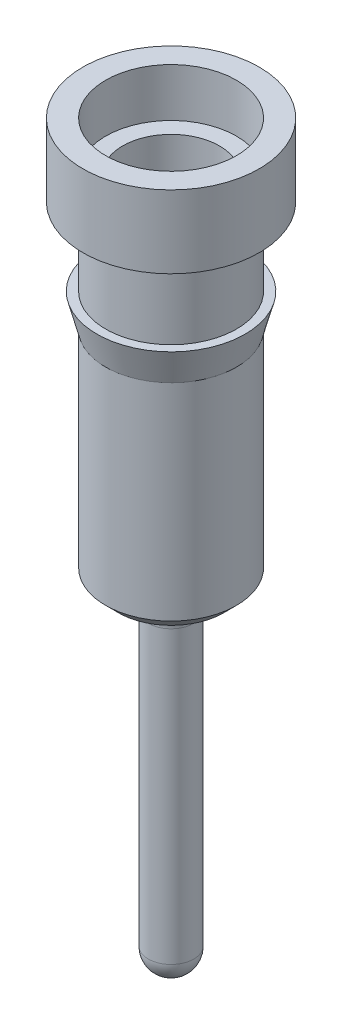
ISO-10303-21;
HEADER;
FILE_DESCRIPTION(('STEP AP214'),'2;1');
FILE_NAME('part.step','',(''),(''),'','','');
FILE_SCHEMA(('AUTOMOTIVE_DESIGN { 1 0 10303 214 1 1 1 1 }'));
ENDSEC;
DATA;
#1=APPLICATION_CONTEXT('core data for automotive mechanical design processes');
#2=APPLICATION_PROTOCOL_DEFINITION('international standard','automotive_design',2000,#1);
#3=PRODUCT_CONTEXT('',#1,'mechanical');
#4=PRODUCT('Part','Part','',(#3));
#5=PRODUCT_RELATED_PRODUCT_CATEGORY('part','',(#4));
#6=PRODUCT_DEFINITION_FORMATION('','',#4);
#7=PRODUCT_DEFINITION_CONTEXT('part definition',#1,'design');
#8=PRODUCT_DEFINITION('design','',#6,#7);
#9=PRODUCT_DEFINITION_SHAPE('','',#8);
#10=(LENGTH_UNIT() NAMED_UNIT(*) SI_UNIT(.MILLI.,.METRE.));
#11=(NAMED_UNIT(*) PLANE_ANGLE_UNIT() SI_UNIT($,.RADIAN.));
#12=(NAMED_UNIT(*) SI_UNIT($,.STERADIAN.) SOLID_ANGLE_UNIT());
#13=UNCERTAINTY_MEASURE_WITH_UNIT(LENGTH_MEASURE(1.E-05),#10,'distance_accuracy_value','');
#14=(GEOMETRIC_REPRESENTATION_CONTEXT(3) GLOBAL_UNCERTAINTY_ASSIGNED_CONTEXT((#13)) GLOBAL_UNIT_ASSIGNED_CONTEXT((#10,
#11,#12)) REPRESENTATION_CONTEXT('',''));
#15=CARTESIAN_POINT('',(0.,0.,0.));
#16=DIRECTION('',(0.,0.,1.));
#17=DIRECTION('',(1.,0.,0.));
#18=AXIS2_PLACEMENT_3D('',#15,#16,#17);
#19=CARTESIAN_POINT('',(0.,0.,0.));
#20=DIRECTION('',(0.,0.,1.));
#21=DIRECTION('',(1.,0.,0.));
#22=AXIS2_PLACEMENT_3D('',#19,#20,#21);
#23=SPHERICAL_SURFACE('',#22,0.235000000000001);
#24=CARTESIAN_POINT('',(0.,0.,0.));
#25=DIRECTION('',(0.,-1.,0.));
#26=DIRECTION('',(0.,0.,-1.));
#27=AXIS2_PLACEMENT_3D('',#24,#25,#26);
#28=SPHERICAL_SURFACE('',#27,0.235000000000001);
#29=CARTESIAN_POINT('',(0.,0.,0.));
#30=DIRECTION('',(0.,-1.,0.));
#31=DIRECTION('',(0.,0.,-1.));
#32=AXIS2_PLACEMENT_3D('',#29,#30,#31);
#33=CIRCLE('',#32,0.235000000000001);
#34=CARTESIAN_POINT('',(0.,0.,-0.235000000000001));
#35=VERTEX_POINT('',#34);
#36=EDGE_CURVE('E49',#35,#35,#33,.T.);
#37=ORIENTED_EDGE('',*,*,#36,.T.);
#38=EDGE_LOOP('',(#37));
#39=FACE_BOUND('',#38,.T.);
#40=ADVANCED_FACE('F31',(#39),#28,.T.);
#41=CARTESIAN_POINT('',(0.,3.33558510638298,0.));
#42=DIRECTION('',(0.,0.,1.));
#43=DIRECTION('',(1.,0.,0.));
#44=AXIS2_PLACEMENT_3D('',#41,#42,#43);
#45=SPHERICAL_SURFACE('',#44,0.649414893617021);
#46=CARTESIAN_POINT('',(0.,3.33558510638298,0.));
#47=DIRECTION('',(0.,-1.,0.));
#48=DIRECTION('',(0.,0.,-1.));
#49=AXIS2_PLACEMENT_3D('',#46,#47,#48);
#50=SPHERICAL_SURFACE('',#49,0.649414893617021);
#51=CARTESIAN_POINT('',(0.,3.75,0.));
#52=DIRECTION('',(0.,-1.,0.));
#53=DIRECTION('',(0.,0.,-1.));
#54=AXIS2_PLACEMENT_3D('',#51,#52,#53);
#55=CIRCLE('',#54,0.5);
#56=CARTESIAN_POINT('',(0.,3.75,-0.5));
#57=VERTEX_POINT('',#56);
#58=EDGE_CURVE('E42',#57,#57,#55,.T.);
#59=ORIENTED_EDGE('',*,*,#58,.F.);
#60=EDGE_LOOP('',(#59));
#61=FACE_BOUND('',#60,.T.);
#62=ADVANCED_FACE('F102',(#61),#50,.T.);
#63=CARTESIAN_POINT('',(0.,0.,0.));
#64=DIRECTION('',(0.,-1.,0.));
#65=DIRECTION('',(0.,0.,-1.));
#66=AXIS2_PLACEMENT_3D('',#63,#64,#65);
#67=CYLINDRICAL_SURFACE('',#66,0.5);
#68=ORIENTED_EDGE('',*,*,#58,.T.);
#69=EDGE_LOOP('',(#68));
#70=FACE_BOUND('',#69,.T.);
#71=CARTESIAN_POINT('',(0.,6.9,0.));
#72=DIRECTION('',(0.,-1.,0.));
#73=DIRECTION('',(0.,0.,-1.));
#74=AXIS2_PLACEMENT_3D('',#71,#72,#73);
#75=CIRCLE('',#74,0.5);
#76=CARTESIAN_POINT('',(0.,6.9,-0.5));
#77=VERTEX_POINT('',#76);
#78=EDGE_CURVE('E46',#77,#77,#75,.T.);
#79=ORIENTED_EDGE('',*,*,#78,.F.);
#80=EDGE_LOOP('',(#79));
#81=FACE_BOUND('',#80,.T.);
#82=ADVANCED_FACE('F107',(#70,#81),#67,.F.);
#83=CARTESIAN_POINT('',(0.5,6.9,0.));
#84=DIRECTION('',(0.,1.,0.));
#85=DIRECTION('',(0.,0.,1.));
#86=AXIS2_PLACEMENT_3D('',#83,#84,#85);
#87=PLANE('',#86);
#88=ORIENTED_EDGE('',*,*,#78,.T.);
#89=EDGE_LOOP('',(#88));
#90=FACE_BOUND('',#89,.T.);
#91=CARTESIAN_POINT('',(0.,6.9,0.));
#92=DIRECTION('',(0.,-1.,0.));
#93=DIRECTION('',(0.,0.,-1.));
#94=AXIS2_PLACEMENT_3D('',#91,#92,#93);
#95=CIRCLE('',#94,0.675);
#96=CARTESIAN_POINT('',(0.,6.9,-0.675));
#97=VERTEX_POINT('',#96);
#98=EDGE_CURVE('E55',#97,#97,#95,.T.);
#99=ORIENTED_EDGE('',*,*,#98,.F.);
#100=EDGE_LOOP('',(#99));
#101=FACE_BOUND('',#100,.T.);
#102=ADVANCED_FACE('F113',(#90,#101),#87,.T.);
#103=CARTESIAN_POINT('',(0.,0.,0.));
#104=DIRECTION('',(0.,-1.,0.));
#105=DIRECTION('',(0.,0.,-1.));
#106=AXIS2_PLACEMENT_3D('',#103,#104,#105);
#107=CYLINDRICAL_SURFACE('',#106,0.675);
#108=ORIENTED_EDGE('',*,*,#98,.T.);
#109=EDGE_LOOP('',(#108));
#110=FACE_BOUND('',#109,.T.);
#111=CARTESIAN_POINT('',(0.,7.4,0.));
#112=DIRECTION('',(0.,-1.,0.));
#113=DIRECTION('',(0.,0.,-1.));
#114=AXIS2_PLACEMENT_3D('',#111,#112,#113);
#115=CIRCLE('',#114,0.675);
#116=CARTESIAN_POINT('',(0.,7.4,-0.675));
#117=VERTEX_POINT('',#116);
#118=EDGE_CURVE('E58',#117,#117,#115,.T.);
#119=ORIENTED_EDGE('',*,*,#118,.F.);
#120=EDGE_LOOP('',(#119));
#121=FACE_BOUND('',#120,.T.);
#122=ADVANCED_FACE('F117',(#110,#121),#107,.F.);
#123=CARTESIAN_POINT('',(0.675,7.4,0.));
#124=DIRECTION('',(0.,1.,0.));
#125=DIRECTION('',(0.,0.,1.));
#126=AXIS2_PLACEMENT_3D('',#123,#124,#125);
#127=PLANE('',#126);
#128=ORIENTED_EDGE('',*,*,#118,.T.);
#129=EDGE_LOOP('',(#128));
#130=FACE_BOUND('',#129,.T.);
#131=CARTESIAN_POINT('',(0.,7.4,0.));
#132=DIRECTION('',(0.,-1.,0.));
#133=DIRECTION('',(0.,0.,-1.));
#134=AXIS2_PLACEMENT_3D('',#131,#132,#133);
#135=CIRCLE('',#134,0.91);
#136=CARTESIAN_POINT('',(0.,7.4,-0.91));
#137=VERTEX_POINT('',#136);
#138=EDGE_CURVE('E61',#137,#137,#135,.T.);
#139=ORIENTED_EDGE('',*,*,#138,.F.);
#140=EDGE_LOOP('',(#139));
#141=FACE_BOUND('',#140,.T.);
#142=ADVANCED_FACE('F121',(#130,#141),#127,.T.);
#143=CARTESIAN_POINT('',(0.,0.,0.));
#144=DIRECTION('',(0.,-1.,0.));
#145=DIRECTION('',(0.,0.,-1.));
#146=AXIS2_PLACEMENT_3D('',#143,#144,#145);
#147=CYLINDRICAL_SURFACE('',#146,0.91);
#148=ORIENTED_EDGE('',*,*,#138,.T.);
#149=EDGE_LOOP('',(#148));
#150=FACE_BOUND('',#149,.T.);
#151=CARTESIAN_POINT('',(0.,6.65,0.));
#152=DIRECTION('',(0.,-1.,0.));
#153=DIRECTION('',(0.,0.,-1.));
#154=AXIS2_PLACEMENT_3D('',#151,#152,#153);
#155=CIRCLE('',#154,0.91);
#156=CARTESIAN_POINT('',(0.,6.65,-0.91));
#157=VERTEX_POINT('',#156);
#158=EDGE_CURVE('E64',#157,#157,#155,.T.);
#159=ORIENTED_EDGE('',*,*,#158,.F.);
#160=EDGE_LOOP('',(#159));
#161=FACE_BOUND('',#160,.T.);
#162=ADVANCED_FACE('F125',(#150,#161),#147,.T.);
#163=CARTESIAN_POINT('',(0.91,6.65,0.));
#164=DIRECTION('',(0.,-1.,0.));
#165=DIRECTION('',(0.,0.,-1.));
#166=AXIS2_PLACEMENT_3D('',#163,#164,#165);
#167=PLANE('',#166);
#168=ORIENTED_EDGE('',*,*,#158,.T.);
#169=EDGE_LOOP('',(#168));
#170=FACE_BOUND('',#169,.T.);
#171=CARTESIAN_POINT('',(0.,6.65,0.));
#172=DIRECTION('',(0.,-1.,0.));
#173=DIRECTION('',(0.,0.,-1.));
#174=AXIS2_PLACEMENT_3D('',#171,#172,#173);
#175=CIRCLE('',#174,0.675);
#176=CARTESIAN_POINT('',(0.,6.65,-0.675));
#177=VERTEX_POINT('',#176);
#178=EDGE_CURVE('E67',#177,#177,#175,.T.);
#179=ORIENTED_EDGE('',*,*,#178,.F.);
#180=EDGE_LOOP('',(#179));
#181=FACE_BOUND('',#180,.T.);
#182=ADVANCED_FACE('F129',(#170,#181),#167,.T.);
#183=CARTESIAN_POINT('',(0.,0.,0.));
#184=DIRECTION('',(0.,-1.,0.));
#185=DIRECTION('',(0.,0.,-1.));
#186=AXIS2_PLACEMENT_3D('',#183,#184,#185);
#187=CYLINDRICAL_SURFACE('',#186,0.675);
#188=ORIENTED_EDGE('',*,*,#178,.T.);
#189=EDGE_LOOP('',(#188));
#190=FACE_BOUND('',#189,.T.);
#191=CARTESIAN_POINT('',(0.,5.85,0.));
#192=DIRECTION('',(0.,-1.,0.));
#193=DIRECTION('',(0.,0.,-1.));
#194=AXIS2_PLACEMENT_3D('',#191,#192,#193);
#195=CIRCLE('',#194,0.675);
#196=CARTESIAN_POINT('',(0.,5.85,-0.675));
#197=VERTEX_POINT('',#196);
#198=EDGE_CURVE('E70',#197,#197,#195,.T.);
#199=ORIENTED_EDGE('',*,*,#198,.F.);
#200=EDGE_LOOP('',(#199));
#201=FACE_BOUND('',#200,.T.);
#202=ADVANCED_FACE('F133',(#190,#201),#187,.T.);
#203=CARTESIAN_POINT('',(0.675,5.85,0.));
#204=DIRECTION('',(0.,1.,0.));
#205=DIRECTION('',(0.,0.,1.));
#206=AXIS2_PLACEMENT_3D('',#203,#204,#205);
#207=PLANE('',#206);
#208=ORIENTED_EDGE('',*,*,#198,.T.);
#209=EDGE_LOOP('',(#208));
#210=FACE_BOUND('',#209,.T.);
#211=CARTESIAN_POINT('',(0.,5.85,0.));
#212=DIRECTION('',(0.,-1.,0.));
#213=DIRECTION('',(0.,0.,-1.));
#214=AXIS2_PLACEMENT_3D('',#211,#212,#213);
#215=CIRCLE('',#214,0.765);
#216=CARTESIAN_POINT('',(0.,5.85,-0.765));
#217=VERTEX_POINT('',#216);
#218=EDGE_CURVE('E73',#217,#217,#215,.T.);
#219=ORIENTED_EDGE('',*,*,#218,.F.);
#220=EDGE_LOOP('',(#219));
#221=FACE_BOUND('',#220,.T.);
#222=ADVANCED_FACE('F137',(#210,#221),#207,.T.);
#223=CARTESIAN_POINT('',(0.,5.51,0.));
#224=DIRECTION('',(0.,1.,0.));
#225=DIRECTION('',(0.,0.,1.));
#226=AXIS2_PLACEMENT_3D('',#223,#224,#225);
#227=CONICAL_SURFACE('',#226,0.675,0.258770891963697);
#228=ORIENTED_EDGE('',*,*,#218,.T.);
#229=EDGE_LOOP('',(#228));
#230=FACE_BOUND('',#229,.T.);
#231=CARTESIAN_POINT('',(0.,5.51,0.));
#232=DIRECTION('',(0.,-1.,0.));
#233=DIRECTION('',(0.,0.,-1.));
#234=AXIS2_PLACEMENT_3D('',#231,#232,#233);
#235=CIRCLE('',#234,0.675);
#236=CARTESIAN_POINT('',(0.,5.51,-0.675));
#237=VERTEX_POINT('',#236);
#238=EDGE_CURVE('E76',#237,#237,#235,.T.);
#239=ORIENTED_EDGE('',*,*,#238,.F.);
#240=EDGE_LOOP('',(#239));
#241=FACE_BOUND('',#240,.T.);
#242=ADVANCED_FACE('F98',(#230,#241),#227,.T.);
#243=CARTESIAN_POINT('',(0.,0.,0.));
#244=DIRECTION('',(0.,-1.,0.));
#245=DIRECTION('',(0.,0.,-1.));
#246=AXIS2_PLACEMENT_3D('',#243,#244,#245);
#247=CYLINDRICAL_SURFACE('',#246,0.675);
#248=ORIENTED_EDGE('',*,*,#238,.T.);
#249=EDGE_LOOP('',(#248));
#250=FACE_BOUND('',#249,.T.);
#251=CARTESIAN_POINT('',(0.,3.38,0.));
#252=DIRECTION('',(0.,-1.,0.));
#253=DIRECTION('',(0.,0.,-1.));
#254=AXIS2_PLACEMENT_3D('',#251,#252,#253);
#255=CIRCLE('',#254,0.675);
#256=CARTESIAN_POINT('',(0.,3.38,-0.675));
#257=VERTEX_POINT('',#256);
#258=EDGE_CURVE('E79',#257,#257,#255,.T.);
#259=ORIENTED_EDGE('',*,*,#258,.F.);
#260=EDGE_LOOP('',(#259));
#261=FACE_BOUND('',#260,.T.);
#262=ADVANCED_FACE('F89',(#250,#261),#247,.T.);
#263=CARTESIAN_POINT('',(0.,3.25,0.));
#264=DIRECTION('',(0.,1.,0.));
#265=DIRECTION('',(0.,0.,1.));
#266=AXIS2_PLACEMENT_3D('',#263,#264,#265);
#267=CONICAL_SURFACE('',#266,0.545,0.785398163397449);
#268=ORIENTED_EDGE('',*,*,#258,.T.);
#269=EDGE_LOOP('',(#268));
#270=FACE_BOUND('',#269,.T.);
#271=CARTESIAN_POINT('',(0.,3.25,0.));
#272=DIRECTION('',(0.,-1.,0.));
#273=DIRECTION('',(0.,0.,-1.));
#274=AXIS2_PLACEMENT_3D('',#271,#272,#273);
#275=CIRCLE('',#274,0.545);
#276=CARTESIAN_POINT('',(0.,3.25,-0.545));
#277=VERTEX_POINT('',#276);
#278=EDGE_CURVE('E51',#277,#277,#275,.T.);
#279=ORIENTED_EDGE('',*,*,#278,.F.);
#280=EDGE_LOOP('',(#279));
#281=FACE_BOUND('',#280,.T.);
#282=ADVANCED_FACE('F87',(#270,#281),#267,.T.);
#283=CARTESIAN_POINT('',(0.545,3.25,0.));
#284=DIRECTION('',(0.,-1.,0.));
#285=DIRECTION('',(0.,0.,-1.));
#286=AXIS2_PLACEMENT_3D('',#283,#284,#285);
#287=PLANE('',#286);
#288=CARTESIAN_POINT('',(0.,3.25,0.));
#289=DIRECTION('',(0.,-1.,0.));
#290=DIRECTION('',(0.,0.,-1.));
#291=AXIS2_PLACEMENT_3D('',#288,#289,#290);
#292=CIRCLE('',#291,0.485000000000001);
#293=CARTESIAN_POINT('',(0.,3.25,-0.485000000000001));
#294=VERTEX_POINT('',#293);
#295=EDGE_CURVE('E10',#294,#294,#292,.F.);
#296=ORIENTED_EDGE('',*,*,#295,.T.);
#297=EDGE_LOOP('',(#296));
#298=FACE_BOUND('',#297,.T.);
#299=ORIENTED_EDGE('',*,*,#278,.T.);
#300=EDGE_LOOP('',(#299));
#301=FACE_BOUND('',#300,.T.);
#302=ADVANCED_FACE('F85',(#298,#301),#287,.T.);
#303=CARTESIAN_POINT('',(0.,0.,0.));
#304=DIRECTION('',(0.,-1.,0.));
#305=DIRECTION('',(0.,0.,-1.));
#306=AXIS2_PLACEMENT_3D('',#303,#304,#305);
#307=CYLINDRICAL_SURFACE('',#306,0.235000000000001);
#308=CARTESIAN_POINT('',(0.,3.,0.));
#309=DIRECTION('',(0.,-1.,0.));
#310=DIRECTION('',(0.,0.,-1.));
#311=AXIS2_PLACEMENT_3D('',#308,#309,#310);
#312=CIRCLE('',#311,0.235000000000001);
#313=CARTESIAN_POINT('',(0.,3.,-0.235000000000001));
#314=VERTEX_POINT('',#313);
#315=EDGE_CURVE('E38',#314,#314,#312,.T.);
#316=ORIENTED_EDGE('',*,*,#315,.T.);
#317=EDGE_LOOP('',(#316));
#318=FACE_BOUND('',#317,.T.);
#319=ORIENTED_EDGE('',*,*,#36,.F.);
#320=EDGE_LOOP('',(#319));
#321=FACE_BOUND('',#320,.T.);
#322=ADVANCED_FACE('F96',(#318,#321),#307,.T.);
#323=CARTESIAN_POINT('',(0.,3.,0.));
#324=DIRECTION('',(0.,-1.,0.));
#325=DIRECTION('',(0.,0.,-1.));
#326=AXIS2_PLACEMENT_3D('',#323,#324,#325);
#327=TOROIDAL_SURFACE('',#326,0.485000000000001,0.25);
#328=ORIENTED_EDGE('',*,*,#295,.F.);
#329=EDGE_LOOP('',(#328));
#330=FACE_BOUND('',#329,.T.);
#331=ORIENTED_EDGE('',*,*,#315,.F.);
#332=EDGE_LOOP('',(#331));
#333=FACE_BOUND('',#332,.T.);
#334=ADVANCED_FACE('F33',(#330,#333),#327,.F.);
#335=CLOSED_SHELL('',(#40,#62,#82,#102,#122,#142,#162,#182,#202,#222,#242,#262,#282,#302,#322,#334));
#336=MANIFOLD_SOLID_BREP('B2',#335);
#337=ADVANCED_BREP_SHAPE_REPRESENTATION('',(#18,#336),#14);
#338=SHAPE_DEFINITION_REPRESENTATION(#9,#337);
ENDSEC;
END-ISO-10303-21;
